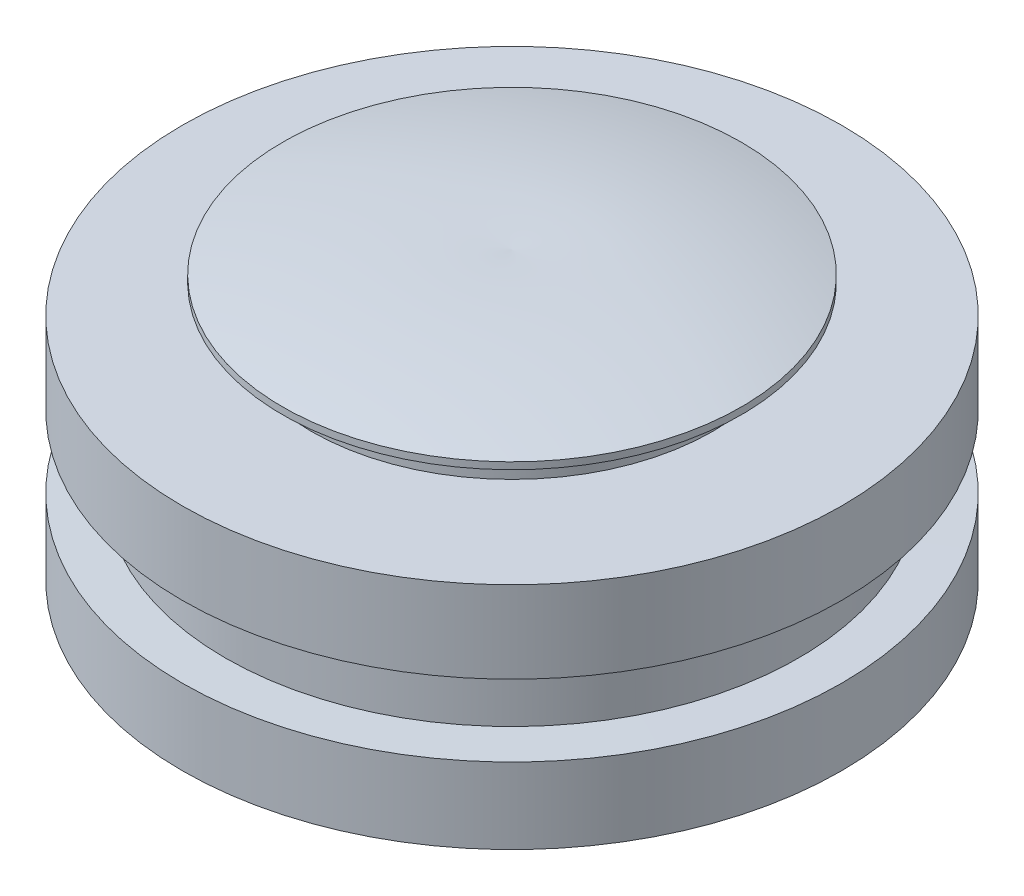
ISO-10303-21;
HEADER;
FILE_DESCRIPTION(('STEP AP214'),'2;1');
FILE_NAME('part.step','',(''),(''),'','','');
FILE_SCHEMA(('AUTOMOTIVE_DESIGN { 1 0 10303 214 1 1 1 1 }'));
ENDSEC;
DATA;
#1=APPLICATION_CONTEXT('core data for automotive mechanical design processes');
#2=APPLICATION_PROTOCOL_DEFINITION('international standard','automotive_design',2000,#1);
#3=PRODUCT_CONTEXT('',#1,'mechanical');
#4=PRODUCT('Part','Part','',(#3));
#5=PRODUCT_RELATED_PRODUCT_CATEGORY('part','',(#4));
#6=PRODUCT_DEFINITION_FORMATION('','',#4);
#7=PRODUCT_DEFINITION_CONTEXT('part definition',#1,'design');
#8=PRODUCT_DEFINITION('design','',#6,#7);
#9=PRODUCT_DEFINITION_SHAPE('','',#8);
#10=(LENGTH_UNIT() NAMED_UNIT(*) SI_UNIT(.MILLI.,.METRE.));
#11=(NAMED_UNIT(*) PLANE_ANGLE_UNIT() SI_UNIT($,.RADIAN.));
#12=(NAMED_UNIT(*) SI_UNIT($,.STERADIAN.) SOLID_ANGLE_UNIT());
#13=UNCERTAINTY_MEASURE_WITH_UNIT(LENGTH_MEASURE(1.E-05),#10,'distance_accuracy_value','');
#14=(GEOMETRIC_REPRESENTATION_CONTEXT(3) GLOBAL_UNCERTAINTY_ASSIGNED_CONTEXT((#13)) GLOBAL_UNIT_ASSIGNED_CONTEXT((#10,
#11,#12)) REPRESENTATION_CONTEXT('',''));
#15=CARTESIAN_POINT('',(0.,0.,0.));
#16=DIRECTION('',(0.,0.,1.));
#17=DIRECTION('',(1.,0.,0.));
#18=AXIS2_PLACEMENT_3D('',#15,#16,#17);
#19=CARTESIAN_POINT('',(0.,-2.98224398331334,0.));
#20=DIRECTION('',(0.,-1.,0.));
#21=DIRECTION('',(0.,0.,-1.));
#22=AXIS2_PLACEMENT_3D('',#19,#20,#21);
#23=CONICAL_SURFACE('',#22,11.5,1.56346441269484);
#24=CARTESIAN_POINT('',(0.,-2.9712459150883,0.));
#25=DIRECTION('',(0.,-1.,0.));
#26=DIRECTION('',(0.,0.,-1.));
#27=AXIS2_PLACEMENT_3D('',#24,#25,#26);
#28=CIRCLE('',#27,10.);
#29=CARTESIAN_POINT('',(0.,-2.9712459150883,-10.));
#30=VERTEX_POINT('',#29);
#31=EDGE_CURVE('E123',#30,#30,#28,.T.);
#32=ORIENTED_EDGE('',*,*,#31,.T.);
#33=EDGE_LOOP('',(#32));
#34=FACE_BOUND('',#33,.T.);
#35=CARTESIAN_POINT('',(0.,-2.98224398331334,0.));
#36=DIRECTION('',(0.,-1.,0.));
#37=DIRECTION('',(0.,0.,-1.));
#38=AXIS2_PLACEMENT_3D('',#35,#36,#37);
#39=CIRCLE('',#38,11.5);
#40=CARTESIAN_POINT('',(0.,-2.98224398331334,-11.5));
#41=VERTEX_POINT('',#40);
#42=EDGE_CURVE('E11',#41,#41,#39,.T.);
#43=ORIENTED_EDGE('',*,*,#42,.F.);
#44=EDGE_LOOP('',(#43));
#45=FACE_BOUND('',#44,.T.);
#46=ADVANCED_FACE('F32',(#34,#45),#23,.T.);
#47=CARTESIAN_POINT('',(0.,3.37256695638316,0.));
#48=DIRECTION('',(0.,-1.,0.));
#49=DIRECTION('',(0.,0.,-1.));
#50=AXIS2_PLACEMENT_3D('',#47,#48,#49);
#51=CYLINDRICAL_SURFACE('',#50,11.5);
#52=ORIENTED_EDGE('',*,*,#42,.T.);
#53=EDGE_LOOP('',(#52));
#54=FACE_BOUND('',#53,.T.);
#55=CARTESIAN_POINT('',(0.,-5.62743304361684,0.));
#56=DIRECTION('',(0.,-1.,0.));
#57=DIRECTION('',(0.,0.,-1.));
#58=AXIS2_PLACEMENT_3D('',#55,#56,#57);
#59=CIRCLE('',#58,11.5);
#60=CARTESIAN_POINT('',(0.,-5.62743304361684,-11.5));
#61=VERTEX_POINT('',#60);
#62=EDGE_CURVE('E39',#61,#61,#59,.T.);
#63=ORIENTED_EDGE('',*,*,#62,.F.);
#64=EDGE_LOOP('',(#63));
#65=FACE_BOUND('',#64,.T.);
#66=ADVANCED_FACE('F73',(#54,#65),#51,.T.);
#67=CARTESIAN_POINT('',(11.5,-5.62743304361684,0.));
#68=DIRECTION('',(0.,-1.,0.));
#69=DIRECTION('',(0.,0.,-1.));
#70=AXIS2_PLACEMENT_3D('',#67,#68,#69);
#71=PLANE('',#70);
#72=ORIENTED_EDGE('',*,*,#62,.T.);
#73=EDGE_LOOP('',(#72));
#74=FACE_BOUND('',#73,.T.);
#75=CARTESIAN_POINT('',(0.,-5.62743304361684,0.));
#76=DIRECTION('',(0.,-1.,0.));
#77=DIRECTION('',(0.,0.,-1.));
#78=AXIS2_PLACEMENT_3D('',#75,#76,#77);
#79=CIRCLE('',#78,6.);
#80=CARTESIAN_POINT('',(0.,-5.62743304361684,-6.));
#81=VERTEX_POINT('',#80);
#82=EDGE_CURVE('E59',#81,#81,#79,.T.);
#83=ORIENTED_EDGE('',*,*,#82,.F.);
#84=EDGE_LOOP('',(#83));
#85=FACE_BOUND('',#84,.T.);
#86=ADVANCED_FACE('F70',(#74,#85),#71,.T.);
#87=CARTESIAN_POINT('',(0.,3.37256695638316,0.));
#88=DIRECTION('',(0.,-1.,0.));
#89=DIRECTION('',(0.,0.,-1.));
#90=AXIS2_PLACEMENT_3D('',#87,#88,#89);
#91=CYLINDRICAL_SURFACE('',#90,6.);
#92=ORIENTED_EDGE('',*,*,#82,.T.);
#93=EDGE_LOOP('',(#92));
#94=FACE_BOUND('',#93,.T.);
#95=CARTESIAN_POINT('',(0.,2.37256695638316,0.));
#96=DIRECTION('',(0.,-1.,0.));
#97=DIRECTION('',(0.,0.,-1.));
#98=AXIS2_PLACEMENT_3D('',#95,#96,#97);
#99=CIRCLE('',#98,6.);
#100=CARTESIAN_POINT('',(0.,2.37256695638316,-6.));
#101=VERTEX_POINT('',#100);
#102=EDGE_CURVE('E55',#101,#101,#99,.T.);
#103=ORIENTED_EDGE('',*,*,#102,.F.);
#104=EDGE_LOOP('',(#103));
#105=FACE_BOUND('',#104,.T.);
#106=ADVANCED_FACE('F80',(#94,#105),#91,.F.);
#107=CARTESIAN_POINT('',(0.,3.37256695638316,0.));
#108=DIRECTION('',(0.,-1.,0.));
#109=DIRECTION('',(0.,0.,-1.));
#110=AXIS2_PLACEMENT_3D('',#107,#108,#109);
#111=CONICAL_SURFACE('',#110,0.,1.40564764938027);
#112=ORIENTED_EDGE('',*,*,#102,.T.);
#113=EDGE_LOOP('',(#112));
#114=FACE_BOUND('',#113,.T.);
#115=CARTESIAN_POINT('',(0.,3.37256695638316,0.));
#116=VERTEX_POINT('',#115);
#117=VERTEX_LOOP('',#116);
#118=FACE_BOUND('',#117,.T.);
#119=ADVANCED_FACE('F49',(#114,#118),#111,.F.);
#120=CARTESIAN_POINT('',(0.,-21.5802218775818,-1.56612634855033));
#121=DIRECTION('',(-1.,0.,0.));
#122=DIRECTION('',(0.,0.,-1.));
#123=AXIS2_PLACEMENT_3D('',#120,#121,#122);
#124=CIRCLE('',#123,26.);
#125=TRIMMED_CURVE('',#124,(PARAMETER_VALUE(-1.63106844098788)),
(PARAMETER_VALUE(1.63106844098788)),.T.,.PARAMETER.);
#126=CARTESIAN_POINT('',(0.,-21.5802218775818,0.));
#127=DIRECTION('',(0.,-1.,0.));
#128=AXIS1_PLACEMENT('',#126,#127);
#129=SURFACE_OF_REVOLUTION('',#125,#128);
#130=CARTESIAN_POINT('',(0.,4.37256695638316,0.));
#131=VERTEX_POINT('',#130);
#132=VERTEX_LOOP('',#131);
#133=FACE_BOUND('',#132,.T.);
#134=CARTESIAN_POINT('',(0.,3.61115104723478,0.));
#135=DIRECTION('',(0.,-1.,0.));
#136=DIRECTION('',(0.,0.,-1.));
#137=AXIS2_PLACEMENT_3D('',#134,#135,#136);
#138=CIRCLE('',#137,8.);
#139=CARTESIAN_POINT('',(0.,3.61115104723478,-8.));
#140=VERTEX_POINT('',#139);
#141=EDGE_CURVE('E53',#140,#140,#138,.T.);
#142=ORIENTED_EDGE('',*,*,#141,.F.);
#143=EDGE_LOOP('',(#142));
#144=FACE_BOUND('',#143,.T.);
#145=ADVANCED_FACE('F45',(#133,#144),#129,.T.);
#146=CARTESIAN_POINT('',(0.,3.37256695638316,0.));
#147=DIRECTION('',(0.,-1.,0.));
#148=DIRECTION('',(0.,0.,-1.));
#149=AXIS2_PLACEMENT_3D('',#146,#147,#148);
#150=CYLINDRICAL_SURFACE('',#149,8.);
#151=ORIENTED_EDGE('',*,*,#141,.T.);
#152=EDGE_LOOP('',(#151));
#153=FACE_BOUND('',#152,.T.);
#154=CARTESIAN_POINT('',(0.,3.37256695638316,0.));
#155=DIRECTION('',(0.,-1.,0.));
#156=DIRECTION('',(0.,0.,-1.));
#157=AXIS2_PLACEMENT_3D('',#154,#155,#156);
#158=CIRCLE('',#157,8.);
#159=CARTESIAN_POINT('',(0.,3.37256695638316,-8.));
#160=VERTEX_POINT('',#159);
#161=EDGE_CURVE('E56',#160,#160,#158,.T.);
#162=ORIENTED_EDGE('',*,*,#161,.F.);
#163=EDGE_LOOP('',(#162));
#164=FACE_BOUND('',#163,.T.);
#165=ADVANCED_FACE('F48',(#153,#164),#150,.T.);
#166=CARTESIAN_POINT('',(7.,3.37256695638316,0.));
#167=DIRECTION('',(0.,-1.,0.));
#168=DIRECTION('',(0.,0.,-1.));
#169=AXIS2_PLACEMENT_3D('',#166,#167,#168);
#170=PLANE('',#169);
#171=ORIENTED_EDGE('',*,*,#161,.T.);
#172=EDGE_LOOP('',(#171));
#173=FACE_BOUND('',#172,.T.);
#174=CARTESIAN_POINT('',(0.,3.37256695638316,0.));
#175=DIRECTION('',(0.,-1.,0.));
#176=DIRECTION('',(0.,0.,-1.));
#177=AXIS2_PLACEMENT_3D('',#174,#175,#176);
#178=CIRCLE('',#177,7.);
#179=CARTESIAN_POINT('',(0.,3.37256695638316,-7.));
#180=VERTEX_POINT('',#179);
#181=EDGE_CURVE('E62',#180,#180,#178,.T.);
#182=ORIENTED_EDGE('',*,*,#181,.F.);
#183=EDGE_LOOP('',(#182));
#184=FACE_BOUND('',#183,.T.);
#185=ADVANCED_FACE('F92',(#173,#184),#170,.T.);
#186=CARTESIAN_POINT('',(0.,3.37256695638316,0.));
#187=DIRECTION('',(0.,-1.,0.));
#188=DIRECTION('',(0.,0.,-1.));
#189=AXIS2_PLACEMENT_3D('',#186,#187,#188);
#190=CYLINDRICAL_SURFACE('',#189,7.);
#191=ORIENTED_EDGE('',*,*,#181,.T.);
#192=EDGE_LOOP('',(#191));
#193=FACE_BOUND('',#192,.T.);
#194=CARTESIAN_POINT('',(0.,2.37256695638316,0.));
#195=DIRECTION('',(0.,-1.,0.));
#196=DIRECTION('',(0.,0.,-1.));
#197=AXIS2_PLACEMENT_3D('',#194,#195,#196);
#198=CIRCLE('',#197,7.);
#199=CARTESIAN_POINT('',(0.,2.37256695638316,-7.));
#200=VERTEX_POINT('',#199);
#201=EDGE_CURVE('E133',#200,#200,#198,.T.);
#202=ORIENTED_EDGE('',*,*,#201,.F.);
#203=EDGE_LOOP('',(#202));
#204=FACE_BOUND('',#203,.T.);
#205=ADVANCED_FACE('F95',(#193,#204),#190,.T.);
#206=CARTESIAN_POINT('',(11.5,2.37256695638316,0.));
#207=DIRECTION('',(0.,1.,0.));
#208=DIRECTION('',(0.,0.,1.));
#209=AXIS2_PLACEMENT_3D('',#206,#207,#208);
#210=PLANE('',#209);
#211=ORIENTED_EDGE('',*,*,#201,.T.);
#212=EDGE_LOOP('',(#211));
#213=FACE_BOUND('',#212,.T.);
#214=CARTESIAN_POINT('',(0.,2.37256695638316,0.));
#215=DIRECTION('',(0.,-1.,0.));
#216=DIRECTION('',(0.,0.,-1.));
#217=AXIS2_PLACEMENT_3D('',#214,#215,#216);
#218=CIRCLE('',#217,11.5);
#219=CARTESIAN_POINT('',(0.,2.37256695638316,-11.5));
#220=VERTEX_POINT('',#219);
#221=EDGE_CURVE('E130',#220,#220,#218,.T.);
#222=ORIENTED_EDGE('',*,*,#221,.F.);
#223=EDGE_LOOP('',(#222));
#224=FACE_BOUND('',#223,.T.);
#225=ADVANCED_FACE('F99',(#213,#224),#210,.T.);
#226=CARTESIAN_POINT('',(0.,3.37256695638316,0.));
#227=DIRECTION('',(0.,-1.,0.));
#228=DIRECTION('',(0.,0.,-1.));
#229=AXIS2_PLACEMENT_3D('',#226,#227,#228);
#230=CYLINDRICAL_SURFACE('',#229,11.5);
#231=ORIENTED_EDGE('',*,*,#221,.T.);
#232=EDGE_LOOP('',(#231));
#233=FACE_BOUND('',#232,.T.);
#234=CARTESIAN_POINT('',(0.,-0.481527002252273,0.));
#235=DIRECTION('',(0.,-1.,0.));
#236=DIRECTION('',(0.,0.,-1.));
#237=AXIS2_PLACEMENT_3D('',#234,#235,#236);
#238=CIRCLE('',#237,11.5);
#239=CARTESIAN_POINT('',(0.,-0.481527002252273,-11.5));
#240=VERTEX_POINT('',#239);
#241=EDGE_CURVE('E125',#240,#240,#238,.T.);
#242=ORIENTED_EDGE('',*,*,#241,.F.);
#243=EDGE_LOOP('',(#242));
#244=FACE_BOUND('',#243,.T.);
#245=ADVANCED_FACE('F103',(#233,#244),#230,.T.);
#246=CARTESIAN_POINT('',(0.,-0.470528934027222,0.));
#247=DIRECTION('',(0.,-1.,0.));
#248=DIRECTION('',(0.,0.,-1.));
#249=AXIS2_PLACEMENT_3D('',#246,#247,#248);
#250=CONICAL_SURFACE('',#249,10.,1.56346441269484);
#251=ORIENTED_EDGE('',*,*,#241,.T.);
#252=EDGE_LOOP('',(#251));
#253=FACE_BOUND('',#252,.T.);
#254=CARTESIAN_POINT('',(0.,-0.470528934027222,0.));
#255=DIRECTION('',(0.,-1.,0.));
#256=DIRECTION('',(0.,0.,-1.));
#257=AXIS2_PLACEMENT_3D('',#254,#255,#256);
#258=CIRCLE('',#257,10.);
#259=CARTESIAN_POINT('',(0.,-0.470528934027222,-10.));
#260=VERTEX_POINT('',#259);
#261=EDGE_CURVE('E120',#260,#260,#258,.T.);
#262=ORIENTED_EDGE('',*,*,#261,.F.);
#263=EDGE_LOOP('',(#262));
#264=FACE_BOUND('',#263,.T.);
#265=ADVANCED_FACE('F107',(#253,#264),#250,.F.);
#266=CARTESIAN_POINT('',(0.,3.37256695638316,0.));
#267=DIRECTION('',(0.,-1.,0.));
#268=DIRECTION('',(0.,0.,-1.));
#269=AXIS2_PLACEMENT_3D('',#266,#267,#268);
#270=CYLINDRICAL_SURFACE('',#269,10.);
#271=ORIENTED_EDGE('',*,*,#261,.T.);
#272=EDGE_LOOP('',(#271));
#273=FACE_BOUND('',#272,.T.);
#274=ORIENTED_EDGE('',*,*,#31,.F.);
#275=EDGE_LOOP('',(#274));
#276=FACE_BOUND('',#275,.T.);
#277=ADVANCED_FACE('F111',(#273,#276),#270,.T.);
#278=CLOSED_SHELL('',(#46,#66,#86,#106,#119,#145,#165,#185,#205,#225,#245,#265,#277));
#279=MANIFOLD_SOLID_BREP('B2',#278);
#280=ADVANCED_BREP_SHAPE_REPRESENTATION('',(#18,#279),#14);
#281=SHAPE_DEFINITION_REPRESENTATION(#9,#280);
ENDSEC;
END-ISO-10303-21;
